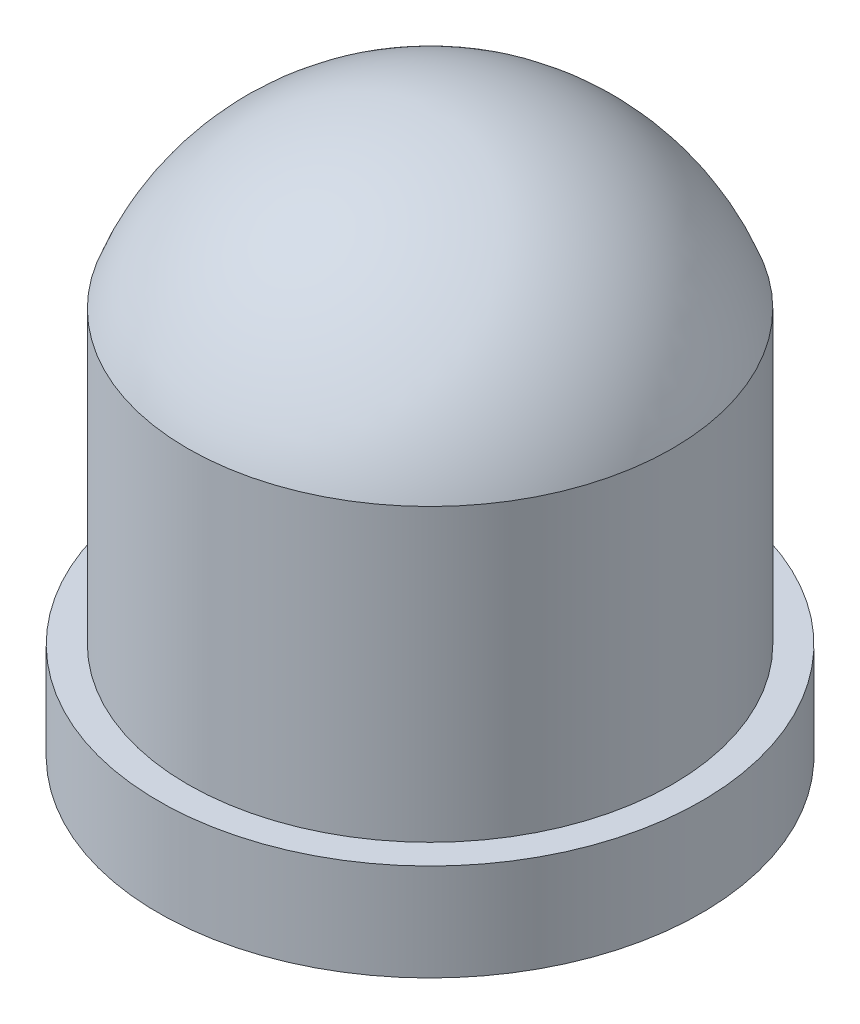
ISO-10303-21;
HEADER;
FILE_DESCRIPTION(('STEP AP214'),'2;1');
FILE_NAME('part.step','',(''),(''),'','','');
FILE_SCHEMA(('AUTOMOTIVE_DESIGN { 1 0 10303 214 1 1 1 1 }'));
ENDSEC;
DATA;
#1=APPLICATION_CONTEXT('core data for automotive mechanical design processes');
#2=APPLICATION_PROTOCOL_DEFINITION('international standard','automotive_design',2000,#1);
#3=PRODUCT_CONTEXT('',#1,'mechanical');
#4=PRODUCT('Part','Part','',(#3));
#5=PRODUCT_RELATED_PRODUCT_CATEGORY('part','',(#4));
#6=PRODUCT_DEFINITION_FORMATION('','',#4);
#7=PRODUCT_DEFINITION_CONTEXT('part definition',#1,'design');
#8=PRODUCT_DEFINITION('design','',#6,#7);
#9=PRODUCT_DEFINITION_SHAPE('','',#8);
#10=(LENGTH_UNIT() NAMED_UNIT(*) SI_UNIT(.MILLI.,.METRE.));
#11=(NAMED_UNIT(*) PLANE_ANGLE_UNIT() SI_UNIT($,.RADIAN.));
#12=(NAMED_UNIT(*) SI_UNIT($,.STERADIAN.) SOLID_ANGLE_UNIT());
#13=UNCERTAINTY_MEASURE_WITH_UNIT(LENGTH_MEASURE(1.E-05),#10,'distance_accuracy_value','');
#14=(GEOMETRIC_REPRESENTATION_CONTEXT(3) GLOBAL_UNCERTAINTY_ASSIGNED_CONTEXT((#13)) GLOBAL_UNIT_ASSIGNED_CONTEXT((#10,
#11,#12)) REPRESENTATION_CONTEXT('',''));
#15=CARTESIAN_POINT('',(0.,0.,0.));
#16=DIRECTION('',(0.,0.,1.));
#17=DIRECTION('',(1.,0.,0.));
#18=AXIS2_PLACEMENT_3D('',#15,#16,#17);
#19=CARTESIAN_POINT('',(0.,0.,0.));
#20=DIRECTION('',(0.,-1.,0.));
#21=DIRECTION('',(0.,0.,-1.));
#22=AXIS2_PLACEMENT_3D('',#19,#20,#21);
#23=PLANE('',#22);
#24=CARTESIAN_POINT('',(0.,0.,0.));
#25=DIRECTION('',(0.,-1.,0.));
#26=DIRECTION('',(0.,0.,-1.));
#27=AXIS2_PLACEMENT_3D('',#24,#25,#26);
#28=CIRCLE('',#27,5.6);
#29=CARTESIAN_POINT('',(0.,0.,-5.6));
#30=VERTEX_POINT('',#29);
#31=EDGE_CURVE('E10',#30,#30,#28,.T.);
#32=ORIENTED_EDGE('',*,*,#31,.T.);
#33=EDGE_LOOP('',(#32));
#34=FACE_BOUND('',#33,.T.);
#35=ADVANCED_FACE('F34',(#34),#23,.T.);
#36=CARTESIAN_POINT('',(0.,0.,0.));
#37=DIRECTION('',(0.,-1.,0.));
#38=DIRECTION('',(0.,0.,-1.));
#39=AXIS2_PLACEMENT_3D('',#36,#37,#38);
#40=CYLINDRICAL_SURFACE('',#39,5.6);
#41=CARTESIAN_POINT('',(0.,2.,0.));
#42=DIRECTION('',(0.,-1.,0.));
#43=DIRECTION('',(0.,0.,-1.));
#44=AXIS2_PLACEMENT_3D('',#41,#42,#43);
#45=CIRCLE('',#44,5.6);
#46=CARTESIAN_POINT('',(0.,2.,-5.6));
#47=VERTEX_POINT('',#46);
#48=EDGE_CURVE('E40',#47,#47,#45,.T.);
#49=ORIENTED_EDGE('',*,*,#48,.T.);
#50=EDGE_LOOP('',(#49));
#51=FACE_BOUND('',#50,.T.);
#52=ORIENTED_EDGE('',*,*,#31,.F.);
#53=EDGE_LOOP('',(#52));
#54=FACE_BOUND('',#53,.T.);
#55=ADVANCED_FACE('F66',(#51,#54),#40,.T.);
#56=CARTESIAN_POINT('',(0.,2.,-5.6));
#57=DIRECTION('',(0.,1.,0.));
#58=DIRECTION('',(0.,0.,1.));
#59=AXIS2_PLACEMENT_3D('',#56,#57,#58);
#60=PLANE('',#59);
#61=CARTESIAN_POINT('',(0.,2.,0.));
#62=DIRECTION('',(0.,-1.,0.));
#63=DIRECTION('',(0.,0.,-1.));
#64=AXIS2_PLACEMENT_3D('',#61,#62,#63);
#65=CIRCLE('',#64,5.);
#66=CARTESIAN_POINT('',(0.,2.,-5.));
#67=VERTEX_POINT('',#66);
#68=EDGE_CURVE('E44',#67,#67,#65,.T.);
#69=ORIENTED_EDGE('',*,*,#68,.T.);
#70=EDGE_LOOP('',(#69));
#71=FACE_BOUND('',#70,.T.);
#72=ORIENTED_EDGE('',*,*,#48,.F.);
#73=EDGE_LOOP('',(#72));
#74=FACE_BOUND('',#73,.T.);
#75=ADVANCED_FACE('F63',(#71,#74),#60,.T.);
#76=CARTESIAN_POINT('',(0.,0.,0.));
#77=DIRECTION('',(0.,-1.,0.));
#78=DIRECTION('',(0.,0.,-1.));
#79=AXIS2_PLACEMENT_3D('',#76,#77,#78);
#80=CYLINDRICAL_SURFACE('',#79,5.);
#81=CARTESIAN_POINT('',(0.,8.,0.));
#82=DIRECTION('',(0.,-1.,0.));
#83=DIRECTION('',(0.,0.,-1.));
#84=AXIS2_PLACEMENT_3D('',#81,#82,#83);
#85=CIRCLE('',#84,5.);
#86=CARTESIAN_POINT('',(0.,8.,-5.));
#87=VERTEX_POINT('',#86);
#88=EDGE_CURVE('E48',#87,#87,#85,.T.);
#89=ORIENTED_EDGE('',*,*,#88,.T.);
#90=EDGE_LOOP('',(#89));
#91=FACE_BOUND('',#90,.T.);
#92=ORIENTED_EDGE('',*,*,#68,.F.);
#93=EDGE_LOOP('',(#92));
#94=FACE_BOUND('',#93,.T.);
#95=ADVANCED_FACE('F54',(#91,#94),#80,.T.);
#96=CARTESIAN_POINT('',(0.,6.17857142857143,0.));
#97=DIRECTION('',(0.,-1.,0.));
#98=DIRECTION('',(0.,0.,-1.));
#99=AXIS2_PLACEMENT_3D('',#96,#97,#98);
#100=SPHERICAL_SURFACE('',#99,5.32142857142857);
#101=ORIENTED_EDGE('',*,*,#88,.F.);
#102=EDGE_LOOP('',(#101));
#103=FACE_BOUND('',#102,.T.);
#104=ADVANCED_FACE('F57',(#103),#100,.T.);
#105=CLOSED_SHELL('',(#35,#55,#75,#95,#104));
#106=MANIFOLD_SOLID_BREP('B2',#105);
#107=ADVANCED_BREP_SHAPE_REPRESENTATION('',(#18,#106),#14);
#108=SHAPE_DEFINITION_REPRESENTATION(#9,#107);
ENDSEC;
END-ISO-10303-21;
